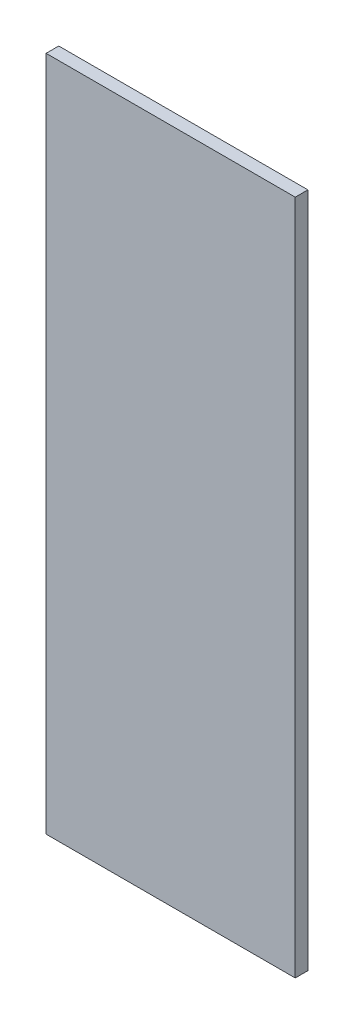
ISO-10303-21;
HEADER;
FILE_DESCRIPTION(('STEP AP214'),'2;1');
FILE_NAME('part.step','',(''),(''),'','','');
FILE_SCHEMA(('AUTOMOTIVE_DESIGN { 1 0 10303 214 1 1 1 1 }'));
ENDSEC;
DATA;
#1=APPLICATION_CONTEXT('core data for automotive mechanical design processes');
#2=APPLICATION_PROTOCOL_DEFINITION('international standard','automotive_design',2000,#1);
#3=PRODUCT_CONTEXT('',#1,'mechanical');
#4=PRODUCT('Part','Part','',(#3));
#5=PRODUCT_RELATED_PRODUCT_CATEGORY('part','',(#4));
#6=PRODUCT_DEFINITION_FORMATION('','',#4);
#7=PRODUCT_DEFINITION_CONTEXT('part definition',#1,'design');
#8=PRODUCT_DEFINITION('design','',#6,#7);
#9=PRODUCT_DEFINITION_SHAPE('','',#8);
#10=(LENGTH_UNIT() NAMED_UNIT(*) SI_UNIT(.MILLI.,.METRE.));
#11=(NAMED_UNIT(*) PLANE_ANGLE_UNIT() SI_UNIT($,.RADIAN.));
#12=(NAMED_UNIT(*) SI_UNIT($,.STERADIAN.) SOLID_ANGLE_UNIT());
#13=UNCERTAINTY_MEASURE_WITH_UNIT(LENGTH_MEASURE(1.E-05),#10,'distance_accuracy_value','');
#14=(GEOMETRIC_REPRESENTATION_CONTEXT(3) GLOBAL_UNCERTAINTY_ASSIGNED_CONTEXT((#13)) GLOBAL_UNIT_ASSIGNED_CONTEXT((#10,
#11,#12)) REPRESENTATION_CONTEXT('',''));
#15=CARTESIAN_POINT('',(0.,0.,0.));
#16=DIRECTION('',(0.,0.,1.));
#17=DIRECTION('',(1.,0.,0.));
#18=AXIS2_PLACEMENT_3D('',#15,#16,#17);
#19=CARTESIAN_POINT('',(94.1920013427735,53.8279991149902,0.));
#20=DIRECTION('',(1.,0.,0.));
#21=DIRECTION('',(0.,-1.,0.));
#22=AXIS2_PLACEMENT_3D('',#19,#20,#21);
#23=PLANE('',#22);
#24=DIRECTION('',(0.,-1.,0.));
#25=VECTOR('',#24,1.);
#26=CARTESIAN_POINT('',(94.1920013427734,53.8279991149902,0.03556));
#27=LINE('',#26,#25);
#28=CARTESIAN_POINT('',(94.1920013427734,53.8279991149902,0.03556));
#29=VERTEX_POINT('',#28);
#30=CARTESIAN_POINT('',(94.1920013427734,51.9280014038086,0.03556));
#31=VERTEX_POINT('',#30);
#32=EDGE_CURVE('E11',#29,#31,#27,.T.);
#33=ORIENTED_EDGE('',*,*,#32,.F.);
#34=DIRECTION('',(0.,0.,1.));
#35=VECTOR('',#34,1.);
#36=CARTESIAN_POINT('',(94.1920013427734,53.8279991149902,0.));
#37=LINE('',#36,#35);
#38=CARTESIAN_POINT('',(94.1920013427734,53.8279991149902,0.));
#39=VERTEX_POINT('',#38);
#40=EDGE_CURVE('E24',#39,#29,#37,.T.);
#41=ORIENTED_EDGE('',*,*,#40,.F.);
#42=DIRECTION('',(0.,-1.,0.));
#43=VECTOR('',#42,1.);
#44=CARTESIAN_POINT('',(94.1920013427734,53.8279991149902,0.));
#45=LINE('',#44,#43);
#46=CARTESIAN_POINT('',(94.1920013427734,51.9280014038086,0.));
#47=VERTEX_POINT('',#46);
#48=EDGE_CURVE('E75',#39,#47,#45,.T.);
#49=ORIENTED_EDGE('',*,*,#48,.T.);
#50=DIRECTION('',(0.,0.,1.));
#51=VECTOR('',#50,1.);
#52=CARTESIAN_POINT('',(94.1920013427734,51.9280014038086,0.));
#53=LINE('',#52,#51);
#54=EDGE_CURVE('E37',#47,#31,#53,.T.);
#55=ORIENTED_EDGE('',*,*,#54,.T.);
#56=EDGE_LOOP('',(#33,#41,#49,#55));
#57=FACE_BOUND('',#56,.T.);
#58=ADVANCED_FACE('F17',(#57),#23,.F.);
#59=CARTESIAN_POINT('',(94.1920013427735,51.9280014038086,0.));
#60=DIRECTION('',(0.,1.,0.));
#61=DIRECTION('',(1.,0.,0.));
#62=AXIS2_PLACEMENT_3D('',#59,#60,#61);
#63=PLANE('',#62);
#64=DIRECTION('',(1.,0.,0.));
#65=VECTOR('',#64,1.);
#66=CARTESIAN_POINT('',(94.1920013427734,51.9280014038086,0.03556));
#67=LINE('',#66,#65);
#68=CARTESIAN_POINT('',(94.8919982910156,51.9280014038086,0.03556));
#69=VERTEX_POINT('',#68);
#70=EDGE_CURVE('E83',#31,#69,#67,.T.);
#71=ORIENTED_EDGE('',*,*,#70,.F.);
#72=ORIENTED_EDGE('',*,*,#54,.F.);
#73=DIRECTION('',(1.,0.,0.));
#74=VECTOR('',#73,1.);
#75=CARTESIAN_POINT('',(94.1920013427734,51.9280014038086,0.));
#76=LINE('',#75,#74);
#77=CARTESIAN_POINT('',(94.8919982910156,51.9280014038086,0.));
#78=VERTEX_POINT('',#77);
#79=EDGE_CURVE('E81',#47,#78,#76,.T.);
#80=ORIENTED_EDGE('',*,*,#79,.T.);
#81=DIRECTION('',(0.,0.,1.));
#82=VECTOR('',#81,1.);
#83=CARTESIAN_POINT('',(94.8919982910156,51.9280014038086,0.));
#84=LINE('',#83,#82);
#85=EDGE_CURVE('E67',#78,#69,#84,.T.);
#86=ORIENTED_EDGE('',*,*,#85,.T.);
#87=EDGE_LOOP('',(#71,#72,#80,#86));
#88=FACE_BOUND('',#87,.T.);
#89=ADVANCED_FACE('F89',(#88),#63,.F.);
#90=CARTESIAN_POINT('',(94.8919982910156,51.9280014038086,0.));
#91=DIRECTION('',(-1.,0.,0.));
#92=DIRECTION('',(0.,1.,0.));
#93=AXIS2_PLACEMENT_3D('',#90,#91,#92);
#94=PLANE('',#93);
#95=DIRECTION('',(0.,1.,0.));
#96=VECTOR('',#95,1.);
#97=CARTESIAN_POINT('',(94.8919982910156,51.9280014038086,0.03556));
#98=LINE('',#97,#96);
#99=CARTESIAN_POINT('',(94.8919982910156,53.8279991149902,0.03556));
#100=VERTEX_POINT('',#99);
#101=EDGE_CURVE('E71',#69,#100,#98,.T.);
#102=ORIENTED_EDGE('',*,*,#101,.F.);
#103=ORIENTED_EDGE('',*,*,#85,.F.);
#104=DIRECTION('',(0.,1.,0.));
#105=VECTOR('',#104,1.);
#106=CARTESIAN_POINT('',(94.8919982910156,51.9280014038086,0.));
#107=LINE('',#106,#105);
#108=CARTESIAN_POINT('',(94.8919982910156,53.8279991149902,0.));
#109=VERTEX_POINT('',#108);
#110=EDGE_CURVE('E63',#78,#109,#107,.T.);
#111=ORIENTED_EDGE('',*,*,#110,.T.);
#112=DIRECTION('',(0.,0.,1.));
#113=VECTOR('',#112,1.);
#114=CARTESIAN_POINT('',(94.8919982910156,53.8279991149902,0.));
#115=LINE('',#114,#113);
#116=EDGE_CURVE('E53',#109,#100,#115,.T.);
#117=ORIENTED_EDGE('',*,*,#116,.T.);
#118=EDGE_LOOP('',(#102,#103,#111,#117));
#119=FACE_BOUND('',#118,.T.);
#120=ADVANCED_FACE('F66',(#119),#94,.F.);
#121=CARTESIAN_POINT('',(94.8919982910156,53.8279991149902,0.));
#122=DIRECTION('',(0.,-1.,0.));
#123=DIRECTION('',(-1.,0.,0.));
#124=AXIS2_PLACEMENT_3D('',#121,#122,#123);
#125=PLANE('',#124);
#126=DIRECTION('',(-1.,0.,0.));
#127=VECTOR('',#126,1.);
#128=CARTESIAN_POINT('',(94.8919982910156,53.8279991149902,0.03556));
#129=LINE('',#128,#127);
#130=EDGE_CURVE('E59',#100,#29,#129,.T.);
#131=ORIENTED_EDGE('',*,*,#130,.F.);
#132=ORIENTED_EDGE('',*,*,#116,.F.);
#133=DIRECTION('',(-1.,0.,0.));
#134=VECTOR('',#133,1.);
#135=CARTESIAN_POINT('',(94.8919982910156,53.8279991149902,0.));
#136=LINE('',#135,#134);
#137=EDGE_CURVE('E57',#109,#39,#136,.T.);
#138=ORIENTED_EDGE('',*,*,#137,.T.);
#139=ORIENTED_EDGE('',*,*,#40,.T.);
#140=EDGE_LOOP('',(#131,#132,#138,#139));
#141=FACE_BOUND('',#140,.T.);
#142=ADVANCED_FACE('F55',(#141),#125,.F.);
#143=CARTESIAN_POINT('',(94.1920013427735,53.8279991149902,0.));
#144=DIRECTION('',(0.,0.,-1.));
#145=DIRECTION('',(-1.,0.,0.));
#146=AXIS2_PLACEMENT_3D('',#143,#144,#145);
#147=PLANE('',#146);
#148=ORIENTED_EDGE('',*,*,#137,.F.);
#149=ORIENTED_EDGE('',*,*,#110,.F.);
#150=ORIENTED_EDGE('',*,*,#79,.F.);
#151=ORIENTED_EDGE('',*,*,#48,.F.);
#152=EDGE_LOOP('',(#148,#149,#150,#151));
#153=FACE_BOUND('',#152,.T.);
#154=ADVANCED_FACE('F74',(#153),#147,.T.);
#155=CARTESIAN_POINT('',(94.1920013427735,53.8279991149902,0.03556));
#156=DIRECTION('',(0.,0.,-1.));
#157=DIRECTION('',(-1.,0.,0.));
#158=AXIS2_PLACEMENT_3D('',#155,#156,#157);
#159=PLANE('',#158);
#160=ORIENTED_EDGE('',*,*,#32,.T.);
#161=ORIENTED_EDGE('',*,*,#70,.T.);
#162=ORIENTED_EDGE('',*,*,#101,.T.);
#163=ORIENTED_EDGE('',*,*,#130,.T.);
#164=EDGE_LOOP('',(#160,#161,#162,#163));
#165=FACE_BOUND('',#164,.T.);
#166=ADVANCED_FACE('F91',(#165),#159,.F.);
#167=CLOSED_SHELL('',(#58,#89,#120,#142,#154,#166));
#168=MANIFOLD_SOLID_BREP('B1',#167);
#169=ADVANCED_BREP_SHAPE_REPRESENTATION('',(#18,#168),#14);
#170=SHAPE_DEFINITION_REPRESENTATION(#9,#169);
ENDSEC;
END-ISO-10303-21;
